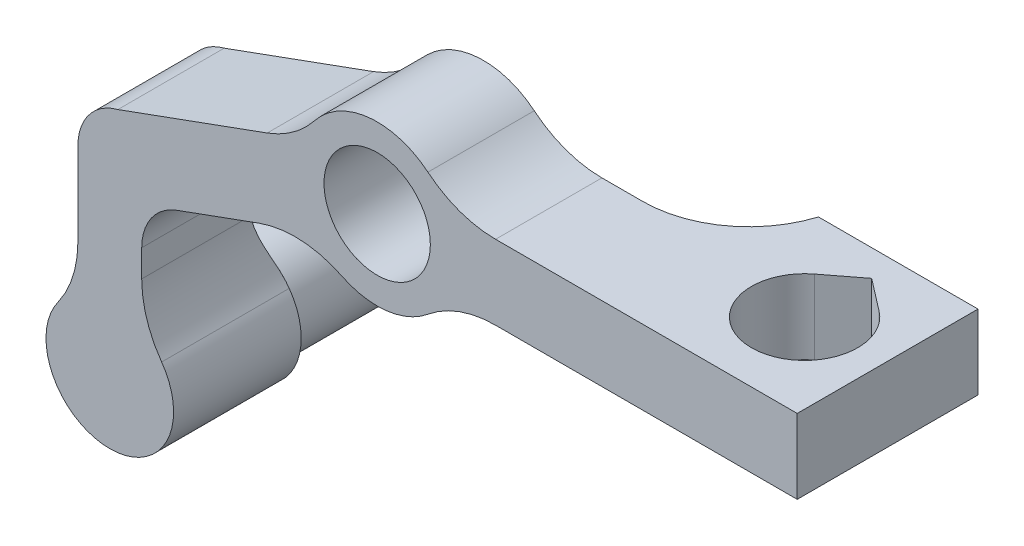
ISO-10303-21;
HEADER;
FILE_DESCRIPTION(('STEP AP214'),'2;1');
FILE_NAME('part.step','',(''),(''),'','','');
FILE_SCHEMA(('AUTOMOTIVE_DESIGN { 1 0 10303 214 1 1 1 1 }'));
ENDSEC;
DATA;
#1=APPLICATION_CONTEXT('core data for automotive mechanical design processes');
#2=APPLICATION_PROTOCOL_DEFINITION('international standard','automotive_design',2000,#1);
#3=PRODUCT_CONTEXT('',#1,'mechanical');
#4=PRODUCT('Part','Part','',(#3));
#5=PRODUCT_RELATED_PRODUCT_CATEGORY('part','',(#4));
#6=PRODUCT_DEFINITION_FORMATION('','',#4);
#7=PRODUCT_DEFINITION_CONTEXT('part definition',#1,'design');
#8=PRODUCT_DEFINITION('design','',#6,#7);
#9=PRODUCT_DEFINITION_SHAPE('','',#8);
#10=(LENGTH_UNIT() NAMED_UNIT(*) SI_UNIT(.MILLI.,.METRE.));
#11=(NAMED_UNIT(*) PLANE_ANGLE_UNIT() SI_UNIT($,.RADIAN.));
#12=(NAMED_UNIT(*) SI_UNIT($,.STERADIAN.) SOLID_ANGLE_UNIT());
#13=UNCERTAINTY_MEASURE_WITH_UNIT(LENGTH_MEASURE(1.E-05),#10,'distance_accuracy_value','');
#14=(GEOMETRIC_REPRESENTATION_CONTEXT(3) GLOBAL_UNCERTAINTY_ASSIGNED_CONTEXT((#13)) GLOBAL_UNIT_ASSIGNED_CONTEXT((#10,
#11,#12)) REPRESENTATION_CONTEXT('',''));
#15=CARTESIAN_POINT('',(0.,0.,0.));
#16=DIRECTION('',(0.,0.,1.));
#17=DIRECTION('',(1.,0.,0.));
#18=AXIS2_PLACEMENT_3D('',#15,#16,#17);
#19=CARTESIAN_POINT('',(0.,0.,-5.));
#20=DIRECTION('',(0.,0.,1.));
#21=DIRECTION('',(1.,0.,0.));
#22=AXIS2_PLACEMENT_3D('',#19,#20,#21);
#23=PLANE('',#22);
#24=CARTESIAN_POINT('',(0.,0.,-5.));
#25=DIRECTION('',(0.,0.,1.));
#26=DIRECTION('',(1.,0.,0.));
#27=AXIS2_PLACEMENT_3D('',#24,#25,#26);
#28=CIRCLE('',#27,5.);
#29=CARTESIAN_POINT('',(5.,0.,-5.));
#30=VERTEX_POINT('',#29);
#31=EDGE_CURVE('E281',#30,#30,#28,.T.);
#32=ORIENTED_EDGE('',*,*,#31,.T.);
#33=EDGE_LOOP('',(#32));
#34=FACE_BOUND('',#33,.T.);
#35=DIRECTION('',(0.,-1.,0.));
#36=VECTOR('',#35,1.);
#37=CARTESIAN_POINT('',(-22.1430839676829,-3.69545322482756,-5.));
#38=LINE('',#37,#36);
#39=CARTESIAN_POINT('',(-22.1430839676829,-13.8292024167432,-5.));
#40=VERTEX_POINT('',#39);
#41=CARTESIAN_POINT('',(-22.1430839676829,-14.0765031862053,-5.));
#42=VERTEX_POINT('',#41);
#43=EDGE_CURVE('E265',#40,#42,#38,.T.);
#44=ORIENTED_EDGE('',*,*,#43,.T.);
#45=CARTESIAN_POINT('',(-25.1430839676829,-25.6954532248276,-5.));
#46=DIRECTION('',(0.,0.,1.));
#47=DIRECTION('',(1.,0.,0.));
#48=AXIS2_PLACEMENT_3D('',#45,#46,#47);
#49=CIRCLE('',#48,12.);
#50=CARTESIAN_POINT('',(-28.1430839676829,-14.0765031862053,-5.));
#51=VERTEX_POINT('',#50);
#52=EDGE_CURVE('E327',#42,#51,#49,.T.);
#53=ORIENTED_EDGE('',*,*,#52,.T.);
#54=DIRECTION('',(0.,-1.,0.));
#55=VECTOR('',#54,1.);
#56=CARTESIAN_POINT('',(-28.1430839676829,-3.69545322482756,-5.));
#57=LINE('',#56,#55);
#58=CARTESIAN_POINT('',(-28.1430839676829,-8.53838025386968,-5.));
#59=VERTEX_POINT('',#58);
#60=EDGE_CURVE('E262',#59,#51,#57,.T.);
#61=ORIENTED_EDGE('',*,*,#60,.F.);
#62=CARTESIAN_POINT('',(-23.1430839676829,-8.53838025386968,-5.));
#63=DIRECTION('',(0.,0.,1.));
#64=DIRECTION('',(1.,0.,0.));
#65=AXIS2_PLACEMENT_3D('',#62,#63,#64);
#66=CIRCLE('',#65,5.);
#67=CARTESIAN_POINT('',(-24.3864896904352,-3.69545322482756,-5.));
#68=VERTEX_POINT('',#67);
#69=EDGE_CURVE('E322',#59,#68,#66,.F.);
#70=ORIENTED_EDGE('',*,*,#69,.T.);
#71=DIRECTION('',(-0.939692620785908,-0.342020143325669,0.));
#72=VECTOR('',#71,1.);
#73=CARTESIAN_POINT('',(-6.60660943281871,2.77589395776218,-5.));
#74=LINE('',#73,#72);
#75=CARTESIAN_POINT('',(-10.3382060479147,1.41770386357871,-5.));
#76=VERTEX_POINT('',#75);
#77=EDGE_CURVE('E284',#76,#68,#74,.T.);
#78=ORIENTED_EDGE('',*,*,#77,.F.);
#79=CARTESIAN_POINT('',(-13.7584074811714,10.8146300714378,-5.));
#80=DIRECTION('',(0.,0.,1.));
#81=DIRECTION('',(1.,0.,0.));
#82=AXIS2_PLACEMENT_3D('',#79,#80,#81);
#83=CIRCLE('',#82,10.);
#84=CARTESIAN_POINT('',(-5.89646034907346,4.63484145918762,-5.));
#85=VERTEX_POINT('',#84);
#86=EDGE_CURVE('E11',#76,#85,#83,.T.);
#87=ORIENTED_EDGE('',*,*,#86,.T.);
#88=CARTESIAN_POINT('',(0.,0.,-5.));
#89=DIRECTION('',(0.,0.,1.));
#90=DIRECTION('',(1.,0.,0.));
#91=AXIS2_PLACEMENT_3D('',#88,#89,#90);
#92=CIRCLE('',#91,7.5);
#93=CARTESIAN_POINT('',(4.7723694538543,5.78571428571429,-5.));
#94=VERTEX_POINT('',#93);
#95=EDGE_CURVE('E290',#94,#85,#92,.T.);
#96=ORIENTED_EDGE('',*,*,#95,.F.);
#97=CARTESIAN_POINT('',(11.13552872566,13.5,-5.));
#98=DIRECTION('',(0.,0.,1.));
#99=DIRECTION('',(1.,0.,0.));
#100=AXIS2_PLACEMENT_3D('',#97,#98,#99);
#101=CIRCLE('',#100,10.);
#102=CARTESIAN_POINT('',(11.13552872566,3.5,-5.));
#103=VERTEX_POINT('',#102);
#104=EDGE_CURVE('E396',#94,#103,#101,.T.);
#105=ORIENTED_EDGE('',*,*,#104,.T.);
#106=DIRECTION('',(1.,0.,0.));
#107=VECTOR('',#106,1.);
#108=CARTESIAN_POINT('',(-26.3411544693228,3.5,-5.));
#109=LINE('',#108,#107);
#110=CARTESIAN_POINT('',(14.9606079858305,3.5,-5.));
#111=VERTEX_POINT('',#110);
#112=EDGE_CURVE('E269',#103,#111,#109,.T.);
#113=ORIENTED_EDGE('',*,*,#112,.T.);
#114=DIRECTION('',(0.,1.,0.));
#115=VECTOR('',#114,1.);
#116=CARTESIAN_POINT('',(14.9606079858305,0.,-5.));
#117=LINE('',#116,#115);
#118=CARTESIAN_POINT('',(14.9606079858305,-3.5,-5.));
#119=VERTEX_POINT('',#118);
#120=EDGE_CURVE('E325',#111,#119,#117,.F.);
#121=ORIENTED_EDGE('',*,*,#120,.T.);
#122=DIRECTION('',(1.,0.,0.));
#123=VECTOR('',#122,1.);
#124=CARTESIAN_POINT('',(-26.3411544693228,-3.5,-5.));
#125=LINE('',#124,#123);
#126=CARTESIAN_POINT('',(11.13552872566,-3.5,-5.));
#127=VERTEX_POINT('',#126);
#128=EDGE_CURVE('E268',#127,#119,#125,.T.);
#129=ORIENTED_EDGE('',*,*,#128,.F.);
#130=CARTESIAN_POINT('',(11.13552872566,-13.5,-5.));
#131=DIRECTION('',(0.,0.,1.));
#132=DIRECTION('',(1.,0.,0.));
#133=AXIS2_PLACEMENT_3D('',#130,#131,#132);
#134=CIRCLE('',#133,10.);
#135=CARTESIAN_POINT('',(4.7723694538543,-5.78571428571428,-5.));
#136=VERTEX_POINT('',#135);
#137=EDGE_CURVE('E402',#127,#136,#134,.T.);
#138=ORIENTED_EDGE('',*,*,#137,.T.);
#139=CARTESIAN_POINT('',(-3.30093901865302,-6.73452311564331,-5.));
#140=VERTEX_POINT('',#139);
#141=EDGE_CURVE('E297',#140,#136,#92,.T.);
#142=ORIENTED_EDGE('',*,*,#141,.F.);
#143=CARTESIAN_POINT('',(-7.70219104352372,-15.7138872698344,-5.));
#144=DIRECTION('',(0.,0.,1.));
#145=DIRECTION('',(1.,0.,0.));
#146=AXIS2_PLACEMENT_3D('',#143,#144,#145);
#147=CIRCLE('',#146,10.);
#148=CARTESIAN_POINT('',(-11.1223924767804,-6.3169610619753,-5.));
#149=VERTEX_POINT('',#148);
#150=EDGE_CURVE('E406',#140,#149,#147,.T.);
#151=ORIENTED_EDGE('',*,*,#150,.T.);
#152=DIRECTION('',(-0.939692620785908,-0.342020143325669,0.));
#153=VECTOR('',#152,1.);
#154=CARTESIAN_POINT('',(-4.21246842953902,-3.80195438773918,-5.));
#155=LINE('',#154,#153);
#156=CARTESIAN_POINT('',(-18.8531846843113,-9.13073931281365,-5.));
#157=VERTEX_POINT('',#156);
#158=EDGE_CURVE('E282',#149,#157,#155,.T.);
#159=ORIENTED_EDGE('',*,*,#158,.T.);
#160=CARTESIAN_POINT('',(-17.1430839676829,-13.8292024167432,-5.));
#161=DIRECTION('',(0.,0.,1.));
#162=DIRECTION('',(1.,0.,0.));
#163=AXIS2_PLACEMENT_3D('',#160,#161,#162);
#164=CIRCLE('',#163,5.);
#165=EDGE_CURVE('E313',#157,#40,#164,.T.);
#166=ORIENTED_EDGE('',*,*,#165,.T.);
#167=EDGE_LOOP('',(#44,#53,#61,#70,#78,#87,#96,#105,#113,#121,#129,#138,#142,#151,#159,#166));
#168=FACE_BOUND('',#167,.T.);
#169=ADVANCED_FACE('F39',(#34,#168),#23,.F.);
#170=CARTESIAN_POINT('',(-4.21246842953902,-3.80195438773918,-5.));
#171=DIRECTION('',(0.342020143325669,-0.939692620785908,0.));
#172=DIRECTION('',(0.939692620785908,0.342020143325669,0.));
#173=AXIS2_PLACEMENT_3D('',#170,#171,#172);
#174=PLANE('',#173);
#175=ORIENTED_EDGE('',*,*,#158,.F.);
#176=DIRECTION('',(0.,0.,-1.));
#177=VECTOR('',#176,1.);
#178=CARTESIAN_POINT('',(-11.1223924767804,-6.3169610619753,-5.));
#179=LINE('',#178,#177);
#180=CARTESIAN_POINT('',(-11.1223924767804,-6.3169610619753,5.));
#181=VERTEX_POINT('',#180);
#182=EDGE_CURVE('E341',#149,#181,#179,.F.);
#183=ORIENTED_EDGE('',*,*,#182,.T.);
#184=DIRECTION('',(-0.939692620785908,-0.342020143325669,0.));
#185=VECTOR('',#184,1.);
#186=CARTESIAN_POINT('',(-4.21246842953902,-3.80195438773918,5.));
#187=LINE('',#186,#185);
#188=CARTESIAN_POINT('',(-18.8531846843113,-9.13073931281365,5.));
#189=VERTEX_POINT('',#188);
#190=EDGE_CURVE('E279',#181,#189,#187,.T.);
#191=ORIENTED_EDGE('',*,*,#190,.T.);
#192=DIRECTION('',(0.,0.,-1.));
#193=VECTOR('',#192,1.);
#194=CARTESIAN_POINT('',(-18.8531846843113,-9.13073931281365,-5.));
#195=LINE('',#194,#193);
#196=EDGE_CURVE('E308',#189,#157,#195,.T.);
#197=ORIENTED_EDGE('',*,*,#196,.T.);
#198=EDGE_LOOP('',(#175,#183,#191,#197));
#199=FACE_BOUND('',#198,.T.);
#200=ADVANCED_FACE('F490',(#199),#174,.T.);
#201=CARTESIAN_POINT('',(-6.60660943281871,2.77589395776218,-5.));
#202=DIRECTION('',(-0.342020143325669,0.939692620785908,0.));
#203=DIRECTION('',(-0.939692620785908,-0.342020143325669,0.));
#204=AXIS2_PLACEMENT_3D('',#201,#202,#203);
#205=PLANE('',#204);
#206=DIRECTION('',(-0.939692620785908,-0.342020143325669,0.));
#207=VECTOR('',#206,1.);
#208=CARTESIAN_POINT('',(-6.60660943281871,2.77589395776218,5.));
#209=LINE('',#208,#207);
#210=CARTESIAN_POINT('',(-10.3382060479147,1.41770386357871,5.));
#211=VERTEX_POINT('',#210);
#212=CARTESIAN_POINT('',(-24.3864896904353,-3.69545322482756,5.));
#213=VERTEX_POINT('',#212);
#214=EDGE_CURVE('E277',#211,#213,#209,.T.);
#215=ORIENTED_EDGE('',*,*,#214,.F.);
#216=DIRECTION('',(0.,0.,-1.));
#217=VECTOR('',#216,1.);
#218=CARTESIAN_POINT('',(-10.3382060479147,1.41770386357871,-5.));
#219=LINE('',#218,#217);
#220=EDGE_CURVE('E354',#211,#76,#219,.T.);
#221=ORIENTED_EDGE('',*,*,#220,.T.);
#222=ORIENTED_EDGE('',*,*,#77,.T.);
#223=DIRECTION('',(0.,0.,1.));
#224=VECTOR('',#223,1.);
#225=CARTESIAN_POINT('',(-24.3864896904353,-3.69545322482756,-4.99999999999998));
#226=LINE('',#225,#224);
#227=EDGE_CURVE('E300',#68,#213,#226,.T.);
#228=ORIENTED_EDGE('',*,*,#227,.T.);
#229=EDGE_LOOP('',(#215,#221,#222,#228));
#230=FACE_BOUND('',#229,.T.);
#231=ADVANCED_FACE('F438',(#230),#205,.T.);
#232=CARTESIAN_POINT('',(0.,0.,5.));
#233=DIRECTION('',(0.,0.,-1.));
#234=DIRECTION('',(-1.,0.,0.));
#235=AXIS2_PLACEMENT_3D('',#232,#233,#234);
#236=CYLINDRICAL_SURFACE('',#235,7.5);
#237=CARTESIAN_POINT('',(0.,0.,5.));
#238=DIRECTION('',(0.,0.,1.));
#239=DIRECTION('',(1.,0.,0.));
#240=AXIS2_PLACEMENT_3D('',#237,#238,#239);
#241=CIRCLE('',#240,7.5);
#242=CARTESIAN_POINT('',(-3.30093901865302,-6.73452311564331,5.));
#243=VERTEX_POINT('',#242);
#244=CARTESIAN_POINT('',(4.7723694538543,-5.78571428571428,5.));
#245=VERTEX_POINT('',#244);
#246=EDGE_CURVE('E296',#243,#245,#241,.T.);
#247=ORIENTED_EDGE('',*,*,#246,.F.);
#248=DIRECTION('',(0.,0.,-1.));
#249=VECTOR('',#248,1.);
#250=CARTESIAN_POINT('',(-3.30093901865302,-6.73452311564331,5.));
#251=LINE('',#250,#249);
#252=EDGE_CURVE('E338',#243,#140,#251,.T.);
#253=ORIENTED_EDGE('',*,*,#252,.T.);
#254=ORIENTED_EDGE('',*,*,#141,.T.);
#255=DIRECTION('',(0.,0.,-1.));
#256=VECTOR('',#255,1.);
#257=CARTESIAN_POINT('',(4.7723694538543,-5.78571428571428,5.));
#258=LINE('',#257,#256);
#259=EDGE_CURVE('E336',#136,#245,#258,.F.);
#260=ORIENTED_EDGE('',*,*,#259,.T.);
#261=EDGE_LOOP('',(#247,#253,#254,#260));
#262=FACE_BOUND('',#261,.T.);
#263=ADVANCED_FACE('F481',(#262),#236,.T.);
#264=CARTESIAN_POINT('',(0.,0.,5.));
#265=DIRECTION('',(0.,0.,1.));
#266=DIRECTION('',(1.,0.,0.));
#267=AXIS2_PLACEMENT_3D('',#264,#265,#266);
#268=PLANE('',#267);
#269=CARTESIAN_POINT('',(4.7723694538543,5.78571428571429,5.));
#270=VERTEX_POINT('',#269);
#271=CARTESIAN_POINT('',(-5.89646034907346,4.63484145918762,5.));
#272=VERTEX_POINT('',#271);
#273=EDGE_CURVE('E293',#270,#272,#241,.T.);
#274=ORIENTED_EDGE('',*,*,#273,.T.);
#275=CARTESIAN_POINT('',(-13.7584074811714,10.8146300714378,5.));
#276=DIRECTION('',(0.,0.,1.));
#277=DIRECTION('',(1.,0.,0.));
#278=AXIS2_PLACEMENT_3D('',#275,#276,#277);
#279=CIRCLE('',#278,10.);
#280=EDGE_CURVE('E54',#272,#211,#279,.F.);
#281=ORIENTED_EDGE('',*,*,#280,.T.);
#282=ORIENTED_EDGE('',*,*,#214,.T.);
#283=CARTESIAN_POINT('',(-23.1430839676829,-8.53838025386968,5.));
#284=DIRECTION('',(0.,0.,1.));
#285=DIRECTION('',(1.,0.,0.));
#286=AXIS2_PLACEMENT_3D('',#283,#284,#285);
#287=CIRCLE('',#286,5.);
#288=CARTESIAN_POINT('',(-28.1430839676829,-8.53838025386968,5.));
#289=VERTEX_POINT('',#288);
#290=EDGE_CURVE('E318',#213,#289,#287,.T.);
#291=ORIENTED_EDGE('',*,*,#290,.T.);
#292=DIRECTION('',(0.,-1.,0.));
#293=VECTOR('',#292,1.);
#294=CARTESIAN_POINT('',(-28.1430839676829,-3.69545322482756,5.));
#295=LINE('',#294,#293);
#296=CARTESIAN_POINT('',(-28.1430839676829,-16.3680741717387,5.));
#297=VERTEX_POINT('',#296);
#298=EDGE_CURVE('E259',#289,#297,#295,.T.);
#299=ORIENTED_EDGE('',*,*,#298,.T.);
#300=CARTESIAN_POINT('',(-38.1430839676829,-16.3680741717387,5.));
#301=DIRECTION('',(0.,0.,1.));
#302=DIRECTION('',(1.,0.,0.));
#303=AXIS2_PLACEMENT_3D('',#300,#301,#302);
#304=CIRCLE('',#303,10.);
#305=CARTESIAN_POINT('',(-30.0180839676829,-22.1976860799192,5.));
#306=VERTEX_POINT('',#305);
#307=EDGE_CURVE('E408',#297,#306,#304,.F.);
#308=ORIENTED_EDGE('',*,*,#307,.T.);
#309=CARTESIAN_POINT('',(-25.1430839676829,-25.6954532248276,5.));
#310=DIRECTION('',(0.,0.,1.));
#311=DIRECTION('',(1.,0.,0.));
#312=AXIS2_PLACEMENT_3D('',#309,#310,#311);
#313=CIRCLE('',#312,6.);
#314=CARTESIAN_POINT('',(-20.2680839676829,-22.1976860799192,5.));
#315=VERTEX_POINT('',#314);
#316=EDGE_CURVE('E500',#306,#315,#313,.T.);
#317=ORIENTED_EDGE('',*,*,#316,.T.);
#318=CARTESIAN_POINT('',(-12.1430839676829,-16.3680741717387,5.));
#319=DIRECTION('',(0.,0.,1.));
#320=DIRECTION('',(1.,0.,0.));
#321=AXIS2_PLACEMENT_3D('',#318,#319,#320);
#322=CIRCLE('',#321,10.);
#323=CARTESIAN_POINT('',(-22.1430839676829,-16.3680741717387,5.));
#324=VERTEX_POINT('',#323);
#325=EDGE_CURVE('E410',#315,#324,#322,.F.);
#326=ORIENTED_EDGE('',*,*,#325,.T.);
#327=DIRECTION('',(0.,-1.,0.));
#328=VECTOR('',#327,1.);
#329=CARTESIAN_POINT('',(-22.1430839676829,-3.69545322482756,5.));
#330=LINE('',#329,#328);
#331=CARTESIAN_POINT('',(-22.1430839676829,-13.8292024167432,5.));
#332=VERTEX_POINT('',#331);
#333=EDGE_CURVE('E257',#332,#324,#330,.T.);
#334=ORIENTED_EDGE('',*,*,#333,.F.);
#335=CARTESIAN_POINT('',(-17.1430839676829,-13.8292024167432,5.));
#336=DIRECTION('',(0.,0.,1.));
#337=DIRECTION('',(1.,0.,0.));
#338=AXIS2_PLACEMENT_3D('',#335,#336,#337);
#339=CIRCLE('',#338,5.);
#340=EDGE_CURVE('E315',#332,#189,#339,.F.);
#341=ORIENTED_EDGE('',*,*,#340,.T.);
#342=ORIENTED_EDGE('',*,*,#190,.F.);
#343=CARTESIAN_POINT('',(-7.70219104352372,-15.7138872698344,5.));
#344=DIRECTION('',(0.,0.,1.));
#345=DIRECTION('',(1.,0.,0.));
#346=AXIS2_PLACEMENT_3D('',#343,#344,#345);
#347=CIRCLE('',#346,10.);
#348=EDGE_CURVE('E404',#181,#243,#347,.F.);
#349=ORIENTED_EDGE('',*,*,#348,.T.);
#350=ORIENTED_EDGE('',*,*,#246,.T.);
#351=CARTESIAN_POINT('',(11.13552872566,-13.5,5.));
#352=DIRECTION('',(0.,0.,1.));
#353=DIRECTION('',(1.,0.,0.));
#354=AXIS2_PLACEMENT_3D('',#351,#352,#353);
#355=CIRCLE('',#354,10.);
#356=CARTESIAN_POINT('',(11.13552872566,-3.5,5.));
#357=VERTEX_POINT('',#356);
#358=EDGE_CURVE('E400',#245,#357,#355,.F.);
#359=ORIENTED_EDGE('',*,*,#358,.T.);
#360=DIRECTION('',(1.,0.,0.));
#361=VECTOR('',#360,1.);
#362=CARTESIAN_POINT('',(-26.3411544693228,-3.5,5.));
#363=LINE('',#362,#361);
#364=CARTESIAN_POINT('',(39.5,-3.5,5.));
#365=VERTEX_POINT('',#364);
#366=EDGE_CURVE('E272',#357,#365,#363,.T.);
#367=ORIENTED_EDGE('',*,*,#366,.T.);
#368=DIRECTION('',(0.,-1.,0.));
#369=VECTOR('',#368,1.);
#370=CARTESIAN_POINT('',(39.5,3.5,5.));
#371=LINE('',#370,#369);
#372=CARTESIAN_POINT('',(39.5,3.5,5.));
#373=VERTEX_POINT('',#372);
#374=EDGE_CURVE('E237',#373,#365,#371,.T.);
#375=ORIENTED_EDGE('',*,*,#374,.F.);
#376=DIRECTION('',(1.,0.,0.));
#377=VECTOR('',#376,1.);
#378=CARTESIAN_POINT('',(-26.3411544693228,3.5,5.));
#379=LINE('',#378,#377);
#380=CARTESIAN_POINT('',(11.13552872566,3.5,5.));
#381=VERTEX_POINT('',#380);
#382=EDGE_CURVE('E273',#381,#373,#379,.T.);
#383=ORIENTED_EDGE('',*,*,#382,.F.);
#384=CARTESIAN_POINT('',(11.13552872566,13.5,5.));
#385=DIRECTION('',(0.,0.,1.));
#386=DIRECTION('',(1.,0.,0.));
#387=AXIS2_PLACEMENT_3D('',#384,#385,#386);
#388=CIRCLE('',#387,10.);
#389=EDGE_CURVE('E398',#381,#270,#388,.F.);
#390=ORIENTED_EDGE('',*,*,#389,.T.);
#391=EDGE_LOOP('',(#274,#281,#282,#291,#299,#308,#317,#326,#334,#341,#342,#349,#350,#359,#367,
#375,#383,#390));
#392=FACE_BOUND('',#391,.T.);
#393=CARTESIAN_POINT('',(0.,0.,5.));
#394=DIRECTION('',(0.,0.,1.));
#395=DIRECTION('',(1.,0.,0.));
#396=AXIS2_PLACEMENT_3D('',#393,#394,#395);
#397=CIRCLE('',#396,5.);
#398=CARTESIAN_POINT('',(5.,0.,5.));
#399=VERTEX_POINT('',#398);
#400=EDGE_CURVE('E287',#399,#399,#397,.T.);
#401=ORIENTED_EDGE('',*,*,#400,.F.);
#402=EDGE_LOOP('',(#401));
#403=FACE_BOUND('',#402,.T.);
#404=ADVANCED_FACE('F450',(#392,#403),#268,.T.);
#405=ORIENTED_EDGE('',*,*,#273,.F.);
#406=DIRECTION('',(0.,0.,-1.));
#407=VECTOR('',#406,1.);
#408=CARTESIAN_POINT('',(4.7723694538543,5.78571428571429,5.));
#409=LINE('',#408,#407);
#410=EDGE_CURVE('E352',#270,#94,#409,.T.);
#411=ORIENTED_EDGE('',*,*,#410,.T.);
#412=ORIENTED_EDGE('',*,*,#95,.T.);
#413=DIRECTION('',(0.,0.,-1.));
#414=VECTOR('',#413,1.);
#415=CARTESIAN_POINT('',(-5.89646034907346,4.63484145918762,5.));
#416=LINE('',#415,#414);
#417=EDGE_CURVE('E349',#85,#272,#416,.F.);
#418=ORIENTED_EDGE('',*,*,#417,.T.);
#419=EDGE_LOOP('',(#405,#411,#412,#418));
#420=FACE_BOUND('',#419,.T.);
#421=ADVANCED_FACE('F447',(#420),#236,.T.);
#422=CARTESIAN_POINT('',(0.,0.,5.));
#423=DIRECTION('',(0.,0.,-1.));
#424=DIRECTION('',(-1.,0.,0.));
#425=AXIS2_PLACEMENT_3D('',#422,#423,#424);
#426=CYLINDRICAL_SURFACE('',#425,5.);
#427=ORIENTED_EDGE('',*,*,#400,.T.);
#428=EDGE_LOOP('',(#427));
#429=FACE_BOUND('',#428,.T.);
#430=ORIENTED_EDGE('',*,*,#31,.F.);
#431=EDGE_LOOP('',(#430));
#432=FACE_BOUND('',#431,.T.);
#433=ADVANCED_FACE('F525',(#429,#432),#426,.F.);
#434=CARTESIAN_POINT('',(-26.3411544693228,-3.5,5.));
#435=DIRECTION('',(0.,-1.,0.));
#436=DIRECTION('',(0.,0.,-1.));
#437=AXIS2_PLACEMENT_3D('',#434,#435,#436);
#438=PLANE('',#437);
#439=CARTESIAN_POINT('',(32.,-3.5,-3.19287620239325));
#440=DIRECTION('',(0.,-1.,0.));
#441=DIRECTION('',(0.,0.,-1.));
#442=AXIS2_PLACEMENT_3D('',#439,#440,#441);
#443=CIRCLE('',#442,5.);
#444=CARTESIAN_POINT('',(35.0477060920935,-3.5,-7.15664808990342));
#445=VERTEX_POINT('',#444);
#446=CARTESIAN_POINT('',(28.9522939079065,-3.5,-7.15664808990341));
#447=VERTEX_POINT('',#446);
#448=EDGE_CURVE('E229',#445,#447,#443,.T.);
#449=ORIENTED_EDGE('',*,*,#448,.F.);
#450=DIRECTION('',(0.792754377502034,0.,0.609541218418708));
#451=VECTOR('',#450,1.);
#452=CARTESIAN_POINT('',(32.,-3.5,-9.5));
#453=LINE('',#452,#451);
#454=CARTESIAN_POINT('',(32.,-3.5,-9.5));
#455=VERTEX_POINT('',#454);
#456=EDGE_CURVE('E214',#455,#445,#453,.T.);
#457=ORIENTED_EDGE('',*,*,#456,.F.);
#458=DIRECTION('',(0.792754377502033,0.,-0.609541218418709));
#459=VECTOR('',#458,1.);
#460=CARTESIAN_POINT('',(32.,-3.5,-9.5));
#461=LINE('',#460,#459);
#462=EDGE_CURVE('E225',#447,#455,#461,.T.);
#463=ORIENTED_EDGE('',*,*,#462,.F.);
#464=EDGE_LOOP('',(#449,#457,#463));
#465=FACE_BOUND('',#464,.T.);
#466=ORIENTED_EDGE('',*,*,#366,.F.);
#467=DIRECTION('',(0.,0.,-1.));
#468=VECTOR('',#467,1.);
#469=CARTESIAN_POINT('',(11.13552872566,-3.5,5.));
#470=LINE('',#469,#468);
#471=EDGE_CURVE('E343',#357,#127,#470,.T.);
#472=ORIENTED_EDGE('',*,*,#471,.T.);
#473=ORIENTED_EDGE('',*,*,#128,.T.);
#474=CARTESIAN_POINT('',(14.9606079858305,-3.5,-15.));
#475=DIRECTION('',(0.,-1.,0.));
#476=DIRECTION('',(0.,0.,-1.));
#477=AXIS2_PLACEMENT_3D('',#474,#475,#476);
#478=CIRCLE('',#477,10.);
#479=CARTESIAN_POINT('',(24.5,-3.5,-12.));
#480=VERTEX_POINT('',#479);
#481=EDGE_CURVE('E412',#119,#480,#478,.F.);
#482=ORIENTED_EDGE('',*,*,#481,.T.);
#483=DIRECTION('',(-1.,0.,0.));
#484=VECTOR('',#483,1.);
#485=CARTESIAN_POINT('',(39.5,-3.5,-12.));
#486=LINE('',#485,#484);
#487=CARTESIAN_POINT('',(39.5,-3.5,-12.));
#488=VERTEX_POINT('',#487);
#489=EDGE_CURVE('E246',#488,#480,#486,.T.);
#490=ORIENTED_EDGE('',*,*,#489,.F.);
#491=DIRECTION('',(0.,0.,1.));
#492=VECTOR('',#491,1.);
#493=CARTESIAN_POINT('',(39.5,-3.5,-12.));
#494=LINE('',#493,#492);
#495=EDGE_CURVE('E249',#488,#365,#494,.T.);
#496=ORIENTED_EDGE('',*,*,#495,.T.);
#497=EDGE_LOOP('',(#466,#472,#473,#482,#490,#496));
#498=FACE_BOUND('',#497,.T.);
#499=ADVANCED_FACE('F231',(#465,#498),#438,.T.);
#500=CARTESIAN_POINT('',(-26.3411544693228,3.5,5.));
#501=DIRECTION('',(0.,1.,0.));
#502=DIRECTION('',(0.,0.,1.));
#503=AXIS2_PLACEMENT_3D('',#500,#501,#502);
#504=PLANE('',#503);
#505=CARTESIAN_POINT('',(32.,3.5,-3.19287620239325));
#506=DIRECTION('',(0.,1.,0.));
#507=DIRECTION('',(0.,0.,1.));
#508=AXIS2_PLACEMENT_3D('',#505,#506,#507);
#509=CIRCLE('',#508,5.);
#510=CARTESIAN_POINT('',(28.9522939079065,3.5,-7.15664808990342));
#511=VERTEX_POINT('',#510);
#512=CARTESIAN_POINT('',(35.0477060920935,3.5,-7.15664808990342));
#513=VERTEX_POINT('',#512);
#514=EDGE_CURVE('E306',#511,#513,#509,.T.);
#515=ORIENTED_EDGE('',*,*,#514,.F.);
#516=DIRECTION('',(-0.792754377502033,0.,0.609541218418709));
#517=VECTOR('',#516,1.);
#518=CARTESIAN_POINT('',(-11.6716917480299,3.5,24.0787438757248));
#519=LINE('',#518,#517);
#520=CARTESIAN_POINT('',(32.,3.5,-9.49999999999999));
#521=VERTEX_POINT('',#520);
#522=EDGE_CURVE('E303',#521,#511,#519,.T.);
#523=ORIENTED_EDGE('',*,*,#522,.F.);
#524=DIRECTION('',(-0.792754377502034,0.,-0.609541218418707));
#525=VECTOR('',#524,1.);
#526=CARTESIAN_POINT('',(2.34158585788123,3.5,-32.3040694641353));
#527=LINE('',#526,#525);
#528=EDGE_CURVE('E217',#513,#521,#527,.T.);
#529=ORIENTED_EDGE('',*,*,#528,.F.);
#530=EDGE_LOOP('',(#515,#523,#529));
#531=FACE_BOUND('',#530,.T.);
#532=ORIENTED_EDGE('',*,*,#112,.F.);
#533=DIRECTION('',(0.,0.,-1.));
#534=VECTOR('',#533,1.);
#535=CARTESIAN_POINT('',(11.13552872566,3.5,5.));
#536=LINE('',#535,#534);
#537=EDGE_CURVE('E346',#103,#381,#536,.F.);
#538=ORIENTED_EDGE('',*,*,#537,.T.);
#539=ORIENTED_EDGE('',*,*,#382,.T.);
#540=DIRECTION('',(0.,0.,1.));
#541=VECTOR('',#540,1.);
#542=CARTESIAN_POINT('',(39.5,3.5,-12.));
#543=LINE('',#542,#541);
#544=CARTESIAN_POINT('',(39.5,3.5,-12.));
#545=VERTEX_POINT('',#544);
#546=EDGE_CURVE('E254',#545,#373,#543,.T.);
#547=ORIENTED_EDGE('',*,*,#546,.F.);
#548=DIRECTION('',(1.,0.,0.));
#549=VECTOR('',#548,1.);
#550=CARTESIAN_POINT('',(39.5,3.5,-12.));
#551=LINE('',#550,#549);
#552=CARTESIAN_POINT('',(24.5,3.5,-12.));
#553=VERTEX_POINT('',#552);
#554=EDGE_CURVE('E242',#553,#545,#551,.T.);
#555=ORIENTED_EDGE('',*,*,#554,.F.);
#556=CARTESIAN_POINT('',(14.9606079858305,3.5,-15.));
#557=DIRECTION('',(0.,1.,0.));
#558=DIRECTION('',(0.,0.,1.));
#559=AXIS2_PLACEMENT_3D('',#556,#557,#558);
#560=CIRCLE('',#559,10.);
#561=EDGE_CURVE('E413',#553,#111,#560,.F.);
#562=ORIENTED_EDGE('',*,*,#561,.T.);
#563=EDGE_LOOP('',(#532,#538,#539,#547,#555,#562));
#564=FACE_BOUND('',#563,.T.);
#565=ADVANCED_FACE('F458',(#531,#564),#504,.T.);
#566=CARTESIAN_POINT('',(-22.1430839676829,-3.69545322482756,5.));
#567=DIRECTION('',(-1.,0.,0.));
#568=DIRECTION('',(0.,0.,1.));
#569=AXIS2_PLACEMENT_3D('',#566,#567,#568);
#570=PLANE('',#569);
#571=ORIENTED_EDGE('',*,*,#333,.T.);
#572=DIRECTION('',(0.,0.,1.));
#573=VECTOR('',#572,1.);
#574=CARTESIAN_POINT('',(-22.1430839676829,-16.3680741717387,5.));
#575=LINE('',#574,#573);
#576=CARTESIAN_POINT('',(-22.1430839676829,-16.3680741717387,-5.24546180964034));
#577=VERTEX_POINT('',#576);
#578=EDGE_CURVE('E62',#324,#577,#575,.F.);
#579=ORIENTED_EDGE('',*,*,#578,.T.);
#580=CARTESIAN_POINT('',(-22.1430839676829,-16.3680741717387,-5.24546180964034));
#581=CARTESIAN_POINT('',(-22.1430839676829,-16.179702392601,-5.2049721228449));
#582=CARTESIAN_POINT('',(-22.1430839676829,-15.9902762887036,-5.16935417384789));
#583=CARTESIAN_POINT('',(-22.1430839676829,-15.6103533299134,-5.10816064832956));
#584=CARTESIAN_POINT('',(-22.1430839676829,-15.4198609475846,-5.08255728156386));
#585=CARTESIAN_POINT('',(-22.1430839676829,-15.0377715280384,-5.04146176461505));
#586=CARTESIAN_POINT('',(-22.1430839676829,-14.8461744157324,-5.02597031011278));
#587=CARTESIAN_POINT('',(-22.1430839676829,-14.4618891802004,-5.00522150807399));
#588=CARTESIAN_POINT('',(-22.1430839676829,-14.2691995042129,-4.99999296832467));
#589=CARTESIAN_POINT('',(-22.1430839676829,-14.0765031862053,-5.));
#590=B_SPLINE_CURVE_WITH_KNOTS('',3,(#580,#581,#582,#583,#584,#585,#586,#587,#588,#589),
.UNSPECIFIED.,.F.,.F.,(4,2,2,2,4),(0.,0.577968513637952,1.15432160166251,1.73071433753454,
2.30872269509582),.UNSPECIFIED.);
#591=EDGE_CURVE('E363',#577,#42,#590,.T.);
#592=ORIENTED_EDGE('',*,*,#591,.T.);
#593=ORIENTED_EDGE('',*,*,#43,.F.);
#594=DIRECTION('',(0.,0.,-1.));
#595=VECTOR('',#594,1.);
#596=CARTESIAN_POINT('',(-22.1430839676829,-13.8292024167432,5.));
#597=LINE('',#596,#595);
#598=EDGE_CURVE('E311',#40,#332,#597,.F.);
#599=ORIENTED_EDGE('',*,*,#598,.T.);
#600=EDGE_LOOP('',(#571,#579,#592,#593,#599));
#601=FACE_BOUND('',#600,.T.);
#602=ADVANCED_FACE('F419',(#601),#570,.F.);
#603=CARTESIAN_POINT('',(-28.1430839676829,-3.69545322482756,5.));
#604=DIRECTION('',(1.,0.,0.));
#605=DIRECTION('',(0.,0.,-1.));
#606=AXIS2_PLACEMENT_3D('',#603,#604,#605);
#607=PLANE('',#606);
#608=CARTESIAN_POINT('',(-28.1430839676829,-14.0765031862053,-5.));
#609=CARTESIAN_POINT('',(-28.1430839676829,-14.2691995042129,-4.99999296832467));
#610=CARTESIAN_POINT('',(-28.1430839676829,-14.4618891802004,-5.00522150807399));
#611=CARTESIAN_POINT('',(-28.1430839676829,-14.8461744157324,-5.02597031011278));
#612=CARTESIAN_POINT('',(-28.1430839676829,-15.0377715280384,-5.04146176461505));
#613=CARTESIAN_POINT('',(-28.1430839676829,-15.4198609475846,-5.08255728156386));
#614=CARTESIAN_POINT('',(-28.1430839676829,-15.6103533299134,-5.10816064832956));
#615=CARTESIAN_POINT('',(-28.1430839676829,-15.9902762887036,-5.16935417384789));
#616=CARTESIAN_POINT('',(-28.1430839676829,-16.179702392601,-5.2049721228449));
#617=CARTESIAN_POINT('',(-28.1430839676829,-16.3680741717387,-5.24546180964034));
#618=B_SPLINE_CURVE_WITH_KNOTS('',3,(#608,#609,#610,#611,#612,#613,#614,#615,#616,#617),
.UNSPECIFIED.,.F.,.F.,(4,2,2,2,4),(0.,0.578008357561275,1.15440109343331,1.73075418145786,
2.30872269509582),.UNSPECIFIED.);
#619=CARTESIAN_POINT('',(-28.1430839676829,-16.3680741717387,-5.24546180964034));
#620=VERTEX_POINT('',#619);
#621=EDGE_CURVE('E356',#51,#620,#618,.T.);
#622=ORIENTED_EDGE('',*,*,#621,.T.);
#623=DIRECTION('',(0.,0.,1.));
#624=VECTOR('',#623,1.);
#625=CARTESIAN_POINT('',(-28.1430839676829,-16.3680741717387,5.));
#626=LINE('',#625,#624);
#627=EDGE_CURVE('E70',#620,#297,#626,.T.);
#628=ORIENTED_EDGE('',*,*,#627,.T.);
#629=ORIENTED_EDGE('',*,*,#298,.F.);
#630=DIRECTION('',(0.,0.,-1.));
#631=VECTOR('',#630,1.);
#632=CARTESIAN_POINT('',(-28.1430839676829,-8.53838025386968,5.));
#633=LINE('',#632,#631);
#634=EDGE_CURVE('E320',#289,#59,#633,.T.);
#635=ORIENTED_EDGE('',*,*,#634,.T.);
#636=ORIENTED_EDGE('',*,*,#60,.T.);
#637=EDGE_LOOP('',(#622,#628,#629,#635,#636));
#638=FACE_BOUND('',#637,.T.);
#639=ADVANCED_FACE('F370',(#638),#607,.F.);
#640=CARTESIAN_POINT('',(39.5,3.5,-12.));
#641=DIRECTION('',(-1.,0.,0.));
#642=DIRECTION('',(0.,0.,1.));
#643=AXIS2_PLACEMENT_3D('',#640,#641,#642);
#644=PLANE('',#643);
#645=ORIENTED_EDGE('',*,*,#374,.T.);
#646=ORIENTED_EDGE('',*,*,#495,.F.);
#647=DIRECTION('',(0.,-1.,0.));
#648=VECTOR('',#647,1.);
#649=CARTESIAN_POINT('',(39.5,3.5,-12.));
#650=LINE('',#649,#648);
#651=EDGE_CURVE('E244',#545,#488,#650,.T.);
#652=ORIENTED_EDGE('',*,*,#651,.F.);
#653=ORIENTED_EDGE('',*,*,#546,.T.);
#654=EDGE_LOOP('',(#645,#646,#652,#653));
#655=FACE_BOUND('',#654,.T.);
#656=ADVANCED_FACE('F472',(#655),#644,.F.);
#657=CARTESIAN_POINT('',(0.,0.,-12.));
#658=DIRECTION('',(0.,0.,-1.));
#659=DIRECTION('',(-1.,0.,0.));
#660=AXIS2_PLACEMENT_3D('',#657,#658,#659);
#661=PLANE('',#660);
#662=DIRECTION('',(0.,1.,0.));
#663=VECTOR('',#662,1.);
#664=CARTESIAN_POINT('',(24.5,3.5,-12.));
#665=LINE('',#664,#663);
#666=EDGE_CURVE('E239',#480,#553,#665,.T.);
#667=ORIENTED_EDGE('',*,*,#666,.T.);
#668=ORIENTED_EDGE('',*,*,#554,.T.);
#669=ORIENTED_EDGE('',*,*,#651,.T.);
#670=ORIENTED_EDGE('',*,*,#489,.T.);
#671=EDGE_LOOP('',(#667,#668,#669,#670));
#672=FACE_BOUND('',#671,.T.);
#673=ADVANCED_FACE('F468',(#672),#661,.T.);
#674=CARTESIAN_POINT('',(32.,7.5,-3.19287620239325));
#675=DIRECTION('',(0.,-1.,0.));
#676=DIRECTION('',(0.,0.,-1.));
#677=AXIS2_PLACEMENT_3D('',#674,#675,#676);
#678=CYLINDRICAL_SURFACE('',#677,5.);
#679=ORIENTED_EDGE('',*,*,#514,.T.);
#680=DIRECTION('',(0.,-1.,0.));
#681=VECTOR('',#680,1.);
#682=CARTESIAN_POINT('',(35.0477060920935,7.5,-7.15664808990342));
#683=LINE('',#682,#681);
#684=EDGE_CURVE('E220',#513,#445,#683,.T.);
#685=ORIENTED_EDGE('',*,*,#684,.T.);
#686=ORIENTED_EDGE('',*,*,#448,.T.);
#687=DIRECTION('',(0.,-1.,0.));
#688=VECTOR('',#687,1.);
#689=CARTESIAN_POINT('',(28.9522939079065,7.5,-7.15664808990342));
#690=LINE('',#689,#688);
#691=EDGE_CURVE('E221',#511,#447,#690,.T.);
#692=ORIENTED_EDGE('',*,*,#691,.F.);
#693=EDGE_LOOP('',(#679,#685,#686,#692));
#694=FACE_BOUND('',#693,.T.);
#695=ADVANCED_FACE('F516',(#694),#678,.F.);
#696=CARTESIAN_POINT('',(32.,7.5,-9.5));
#697=DIRECTION('',(0.609541218418707,0.,-0.792754377502034));
#698=DIRECTION('',(-0.792754377502034,0.,-0.609541218418707));
#699=AXIS2_PLACEMENT_3D('',#696,#697,#698);
#700=PLANE('',#699);
#701=ORIENTED_EDGE('',*,*,#528,.T.);
#702=DIRECTION('',(0.,-1.,0.));
#703=VECTOR('',#702,1.);
#704=CARTESIAN_POINT('',(32.,7.5,-9.5));
#705=LINE('',#704,#703);
#706=EDGE_CURVE('E209',#521,#455,#705,.T.);
#707=ORIENTED_EDGE('',*,*,#706,.T.);
#708=ORIENTED_EDGE('',*,*,#456,.T.);
#709=ORIENTED_EDGE('',*,*,#684,.F.);
#710=EDGE_LOOP('',(#701,#707,#708,#709));
#711=FACE_BOUND('',#710,.T.);
#712=ADVANCED_FACE('F211',(#711),#700,.F.);
#713=CARTESIAN_POINT('',(32.,7.5,-9.5));
#714=DIRECTION('',(-0.609541218418709,0.,-0.792754377502033));
#715=DIRECTION('',(-0.792754377502033,0.,0.609541218418709));
#716=AXIS2_PLACEMENT_3D('',#713,#714,#715);
#717=PLANE('',#716);
#718=ORIENTED_EDGE('',*,*,#522,.T.);
#719=ORIENTED_EDGE('',*,*,#691,.T.);
#720=ORIENTED_EDGE('',*,*,#462,.T.);
#721=ORIENTED_EDGE('',*,*,#706,.F.);
#722=EDGE_LOOP('',(#718,#719,#720,#721));
#723=FACE_BOUND('',#722,.T.);
#724=ADVANCED_FACE('F226',(#723),#717,.F.);
#725=CARTESIAN_POINT('',(-25.1430839676829,-25.6954532248276,-7.));
#726=DIRECTION('',(0.,0.,1.));
#727=DIRECTION('',(1.,0.,0.));
#728=AXIS2_PLACEMENT_3D('',#725,#726,#727);
#729=CYLINDRICAL_SURFACE('',#728,6.);
#730=CARTESIAN_POINT('',(-25.1430839676829,-25.6954532248276,-7.));
#731=DIRECTION('',(0.,0.,1.));
#732=DIRECTION('',(1.,0.,0.));
#733=AXIS2_PLACEMENT_3D('',#730,#731,#732);
#734=CIRCLE('',#733,6.);
#735=CARTESIAN_POINT('',(-30.0180839676829,-22.1976860799192,-7.));
#736=VERTEX_POINT('',#735);
#737=CARTESIAN_POINT('',(-20.2680839676829,-22.1976860799192,-7.));
#738=VERTEX_POINT('',#737);
#739=EDGE_CURVE('E514',#736,#738,#734,.T.);
#740=ORIENTED_EDGE('',*,*,#739,.T.);
#741=DIRECTION('',(0.,0.,1.));
#742=VECTOR('',#741,1.);
#743=CARTESIAN_POINT('',(-20.2680839676829,-22.1976860799192,-7.));
#744=LINE('',#743,#742);
#745=EDGE_CURVE('E332',#738,#315,#744,.T.);
#746=ORIENTED_EDGE('',*,*,#745,.T.);
#747=ORIENTED_EDGE('',*,*,#316,.F.);
#748=DIRECTION('',(0.,0.,1.));
#749=VECTOR('',#748,1.);
#750=CARTESIAN_POINT('',(-30.0180839676829,-22.1976860799192,-7.));
#751=LINE('',#750,#749);
#752=EDGE_CURVE('E330',#306,#736,#751,.F.);
#753=ORIENTED_EDGE('',*,*,#752,.T.);
#754=EDGE_LOOP('',(#740,#746,#747,#753));
#755=FACE_BOUND('',#754,.T.);
#756=ADVANCED_FACE('F633',(#755),#729,.T.);
#757=CARTESIAN_POINT('',(-25.1430839676829,-25.6954532248276,-7.));
#758=DIRECTION('',(0.,0.,1.));
#759=DIRECTION('',(1.,0.,0.));
#760=AXIS2_PLACEMENT_3D('',#757,#758,#759);
#761=PLANE('',#760);
#762=CARTESIAN_POINT('',(-25.1430839676829,-25.6954532248276,-7.));
#763=DIRECTION('',(0.,0.,1.));
#764=DIRECTION('',(1.,0.,0.));
#765=AXIS2_PLACEMENT_3D('',#762,#763,#764);
#766=CIRCLE('',#765,5.);
#767=CARTESIAN_POINT('',(-20.1430839676829,-25.6954532248276,-7.));
#768=VERTEX_POINT('',#767);
#769=EDGE_CURVE('E503',#768,#768,#766,.T.);
#770=ORIENTED_EDGE('',*,*,#769,.T.);
#771=EDGE_LOOP('',(#770));
#772=FACE_BOUND('',#771,.T.);
#773=EDGE_CURVE('E512',#738,#736,#734,.T.);
#774=ORIENTED_EDGE('',*,*,#773,.F.);
#775=ORIENTED_EDGE('',*,*,#739,.F.);
#776=EDGE_LOOP('',(#774,#775));
#777=FACE_BOUND('',#776,.T.);
#778=ADVANCED_FACE('F625',(#772,#777),#761,.F.);
#779=CARTESIAN_POINT('',(-25.1430839676829,-25.6954532248276,-30.));
#780=DIRECTION('',(0.,0.,1.));
#781=DIRECTION('',(1.,0.,0.));
#782=AXIS2_PLACEMENT_3D('',#779,#780,#781);
#783=CYLINDRICAL_SURFACE('',#782,5.);
#784=CARTESIAN_POINT('',(-25.1430839676829,-25.6954532248276,-30.));
#785=DIRECTION('',(0.,0.,1.));
#786=DIRECTION('',(1.,0.,0.));
#787=AXIS2_PLACEMENT_3D('',#784,#785,#786);
#788=CIRCLE('',#787,5.);
#789=CARTESIAN_POINT('',(-20.1430839676829,-25.6954532248276,-30.));
#790=VERTEX_POINT('',#789);
#791=EDGE_CURVE('E505',#790,#790,#788,.T.);
#792=ORIENTED_EDGE('',*,*,#791,.T.);
#793=EDGE_LOOP('',(#792));
#794=FACE_BOUND('',#793,.T.);
#795=ORIENTED_EDGE('',*,*,#769,.F.);
#796=EDGE_LOOP('',(#795));
#797=FACE_BOUND('',#796,.T.);
#798=ADVANCED_FACE('F616',(#794,#797),#783,.T.);
#799=CARTESIAN_POINT('',(-25.1430839676829,-25.6954532248276,-30.));
#800=DIRECTION('',(0.,0.,1.));
#801=DIRECTION('',(1.,0.,0.));
#802=AXIS2_PLACEMENT_3D('',#799,#800,#801);
#803=PLANE('',#802);
#804=ORIENTED_EDGE('',*,*,#791,.F.);
#805=EDGE_LOOP('',(#804));
#806=FACE_BOUND('',#805,.T.);
#807=ADVANCED_FACE('F541',(#806),#803,.F.);
#808=CARTESIAN_POINT('',(-17.1430839676829,-13.8292024167432,-5.));
#809=DIRECTION('',(0.,0.,-1.));
#810=DIRECTION('',(-1.,0.,0.));
#811=AXIS2_PLACEMENT_3D('',#808,#809,#810);
#812=CYLINDRICAL_SURFACE('',#811,5.);
#813=ORIENTED_EDGE('',*,*,#340,.F.);
#814=ORIENTED_EDGE('',*,*,#598,.F.);
#815=ORIENTED_EDGE('',*,*,#165,.F.);
#816=ORIENTED_EDGE('',*,*,#196,.F.);
#817=EDGE_LOOP('',(#813,#814,#815,#816));
#818=FACE_BOUND('',#817,.T.);
#819=ADVANCED_FACE('F495',(#818),#812,.F.);
#820=CARTESIAN_POINT('',(-23.1430839676829,-8.53838025386968,0.));
#821=DIRECTION('',(0.,0.,-1.));
#822=DIRECTION('',(-1.,0.,0.));
#823=AXIS2_PLACEMENT_3D('',#820,#821,#822);
#824=CYLINDRICAL_SURFACE('',#823,5.);
#825=ORIENTED_EDGE('',*,*,#69,.F.);
#826=ORIENTED_EDGE('',*,*,#634,.F.);
#827=ORIENTED_EDGE('',*,*,#290,.F.);
#828=ORIENTED_EDGE('',*,*,#227,.F.);
#829=EDGE_LOOP('',(#825,#826,#827,#828));
#830=FACE_BOUND('',#829,.T.);
#831=ADVANCED_FACE('F434',(#830),#824,.T.);
#832=CARTESIAN_POINT('',(-12.1430839676829,-16.3680741717387,-7.));
#833=DIRECTION('',(0.,0.,1.));
#834=DIRECTION('',(1.,0.,0.));
#835=AXIS2_PLACEMENT_3D('',#832,#833,#834);
#836=CYLINDRICAL_SURFACE('',#835,10.);
#837=ORIENTED_EDGE('',*,*,#325,.F.);
#838=ORIENTED_EDGE('',*,*,#745,.F.);
#839=CARTESIAN_POINT('',(-20.2680839676829,-22.1976860799192,-7.));
#840=CARTESIAN_POINT('',(-20.3096683139029,-22.1397314109233,-7.00001209047432));
#841=CARTESIAN_POINT('',(-20.3506270931754,-22.0813328390575,-6.99847391108424));
#842=CARTESIAN_POINT('',(-20.4312067443134,-21.9637945233637,-6.99238683727588));
#843=CARTESIAN_POINT('',(-20.4708279364771,-21.9046549616908,-6.9878386690811));
#844=CARTESIAN_POINT('',(-20.5485592255441,-21.7859159743336,-6.97583781184894));
#845=CARTESIAN_POINT('',(-20.5866731623841,-21.7263182508533,-6.96839310854367));
#846=CARTESIAN_POINT('',(-20.661451807556,-21.6066226997041,-6.95076544551608));
#847=CARTESIAN_POINT('',(-20.6981164399079,-21.5465248460153,-6.94058234245041));
#848=CARTESIAN_POINT('',(-20.8051885210233,-21.3667998557426,-6.90644521474964));
#849=CARTESIAN_POINT('',(-20.8734360047461,-21.2465752516421,-6.87877800921797));
#850=CARTESIAN_POINT('',(-21.0040932206454,-21.0050346152715,-6.81537031558215));
#851=CARTESIAN_POINT('',(-21.066498523988,-20.8837178301966,-6.77962377167662));
#852=CARTESIAN_POINT('',(-21.1836297526985,-20.6442533467362,-6.70335012372157));
#853=CARTESIAN_POINT('',(-21.2385408211581,-20.5261327533817,-6.66301907174833));
#854=CARTESIAN_POINT('',(-21.3432336960509,-20.2890489360034,-6.57835819629151));
#855=CARTESIAN_POINT('',(-21.3930146285892,-20.1700855720941,-6.5340276939243));
#856=CARTESIAN_POINT('',(-21.4876887462633,-19.9310645911029,-6.4427970481334));
#857=CARTESIAN_POINT('',(-21.5325771656707,-19.811006028381,-6.3958944649446));
#858=CARTESIAN_POINT('',(-21.6175662594045,-19.5697212125275,-6.30082089554059));
#859=CARTESIAN_POINT('',(-21.65766733635,-19.4484950585192,-6.25265001640652));
#860=CARTESIAN_POINT('',(-21.7333765415173,-19.2040470881855,-6.15586161263509));
#861=CARTESIAN_POINT('',(-21.7689607216666,-19.0808182484681,-6.10724306294837));
#862=CARTESIAN_POINT('',(-21.8354269335055,-18.8328185650296,-6.01073040922635));
#863=CARTESIAN_POINT('',(-21.8663087054731,-18.7080476365476,-5.96283634533711));
#864=CARTESIAN_POINT('',(-21.9518168563579,-18.3314927169847,-5.82157313967758));
#865=CARTESIAN_POINT('',(-21.9993951289295,-18.0771797093514,-5.73050516520709));
#866=CARTESIAN_POINT('',(-22.0719650057689,-17.582428385861,-5.56669129752984));
#867=CARTESIAN_POINT('',(-22.0984595634984,-17.3425086312139,-5.49306234245211));
#868=CARTESIAN_POINT('',(-22.1251245444115,-16.9792771733373,-5.39240392843091));
#869=CARTESIAN_POINT('',(-22.1318331970616,-16.8577657409984,-5.36050924029373));
#870=CARTESIAN_POINT('',(-22.1408138283737,-16.613674098974,-5.30025315737584));
#871=CARTESIAN_POINT('',(-22.1430846004483,-16.4910936077255,-5.27189272546342));
#872=CARTESIAN_POINT('',(-22.1430839676829,-16.3680741717387,-5.24546180964034));
#873=B_SPLINE_CURVE_WITH_KNOTS('',3,(#839,#840,#841,#842,#843,#844,#845,#846,#847,#848,#849,
#850,#851,#852,#853,#854,#855,#856,#857,#858,#859,#860,#861,#862,#863,#864,#865,#866,#867,#868,
#869,#870,#871,#872),.UNSPECIFIED.,.F.,.F.,(4,2,2,2,2,2,2,2,2,2,2,2,2,2,2,2,4),(0.,
0.213963430410622,0.427875256425554,0.64120146064369,0.854538833736927,1.27703193478639,
1.69984276846894,2.10873842933518,2.51770362893992,2.92706370109476,3.33638932146207,
3.74780175138012,4.15923689607699,4.98114156525448,5.73726526414255,6.11456606494783,
6.491969433424),.UNSPECIFIED.);
#874=EDGE_CURVE('E43',#577,#738,#873,.F.);
#875=ORIENTED_EDGE('',*,*,#874,.F.);
#876=ORIENTED_EDGE('',*,*,#578,.F.);
#877=EDGE_LOOP('',(#837,#838,#875,#876));
#878=FACE_BOUND('',#877,.T.);
#879=ADVANCED_FACE('F382',(#878),#836,.F.);
#880=CARTESIAN_POINT('',(-38.1430839676829,-16.3680741717387,-7.));
#881=DIRECTION('',(0.,0.,1.));
#882=DIRECTION('',(1.,0.,0.));
#883=AXIS2_PLACEMENT_3D('',#880,#881,#882);
#884=CYLINDRICAL_SURFACE('',#883,10.);
#885=ORIENTED_EDGE('',*,*,#627,.F.);
#886=CARTESIAN_POINT('',(-28.1430839676829,-16.3680741717387,-5.24546180964034));
#887=CARTESIAN_POINT('',(-28.1430823416111,-16.4943123262491,-5.27258084936983));
#888=CARTESIAN_POINT('',(-28.145474237576,-16.6200973650006,-5.30173896582935));
#889=CARTESIAN_POINT('',(-28.15492994854,-16.8705358139529,-5.36376908519065));
#890=CARTESIAN_POINT('',(-28.1619924456516,-16.9951895333192,-5.39664003828506));
#891=CARTESIAN_POINT('',(-28.1806566715385,-17.2429765158458,-5.46568182436624));
#892=CARTESIAN_POINT('',(-28.1922497784749,-17.3661122114041,-5.50184629006517));
#893=CARTESIAN_POINT('',(-28.2198606712874,-17.6109821508688,-5.57710984696098));
#894=CARTESIAN_POINT('',(-28.2358787649907,-17.7327162966616,-5.61620914218346));
#895=CARTESIAN_POINT('',(-28.2909250196995,-18.0991346908659,-5.73838559482685));
#896=CARTESIAN_POINT('',(-28.3366781137402,-18.341542480529,-5.82534606071405));
#897=CARTESIAN_POINT('',(-28.4453166942234,-18.8203522038558,-6.00496417650334));
#898=CARTESIAN_POINT('',(-28.508208229385,-19.056751984831,-6.09762382887885));
#899=CARTESIAN_POINT('',(-28.6332783256232,-19.4660121160675,-6.25953244709863));
#900=CARTESIAN_POINT('',(-28.6917135534198,-19.6399985901723,-6.32884967154094));
#901=CARTESIAN_POINT('',(-28.8185675588717,-19.9857124397304,-6.46406342801308));
#902=CARTESIAN_POINT('',(-28.8869874707262,-20.1574395561152,-6.52995957027435));
#903=CARTESIAN_POINT('',(-29.0335990610786,-20.4973843852612,-6.65360758753982));
#904=CARTESIAN_POINT('',(-29.1116831287705,-20.6656200269773,-6.7114361771895));
#905=CARTESIAN_POINT('',(-29.2787539804907,-21.000411763172,-6.81483969743805));
#906=CARTESIAN_POINT('',(-29.3677295737099,-21.1669693944032,-6.86042705431676));
#907=CARTESIAN_POINT('',(-29.5041272074703,-21.405489077971,-6.9136333672145));
#908=CARTESIAN_POINT('',(-29.5470906745849,-21.4784676139276,-6.92825744347354));
#909=CARTESIAN_POINT('',(-29.6351642172289,-21.6237869705513,-6.95369276368088));
#910=CARTESIAN_POINT('',(-29.680273954017,-21.69612788973,-6.9645046070553));
#911=CARTESIAN_POINT('',(-29.7729895577652,-21.8406375265122,-6.98205577152423));
#912=CARTESIAN_POINT('',(-29.8206143357738,-21.9127987469569,-6.98875731094275));
#913=CARTESIAN_POINT('',(-29.9178768650464,-22.0560872288144,-6.99774358584527));
#914=CARTESIAN_POINT('',(-29.9675157029607,-22.1272139031717,-7.00002590377512));
#915=CARTESIAN_POINT('',(-30.0180839676829,-22.1976860799192,-7.));
#916=B_SPLINE_CURVE_WITH_KNOTS('',3,(#886,#887,#888,#889,#890,#891,#892,#893,#894,#895,#896,
#897,#898,#899,#900,#901,#902,#903,#904,#905,#906,#907,#908,#909,#910,#911,#912,#913,#914,#915),
.UNSPECIFIED.,.F.,.F.,(4,2,2,2,2,2,2,2,2,2,2,2,2,2,4),(0.,0.387293866618315,0.774478498442978,
1.160929870475,1.54740813303851,2.33125422725059,3.11537732560963,3.70370309732528,
4.29209575136267,4.87444359583144,5.45619803513007,5.71392219016583,5.97160580319995,
6.23162385766045,6.49178411597393),.UNSPECIFIED.);
#917=EDGE_CURVE('E387',#736,#620,#916,.F.);
#918=ORIENTED_EDGE('',*,*,#917,.F.);
#919=ORIENTED_EDGE('',*,*,#752,.F.);
#920=ORIENTED_EDGE('',*,*,#307,.F.);
#921=EDGE_LOOP('',(#885,#918,#919,#920));
#922=FACE_BOUND('',#921,.T.);
#923=ADVANCED_FACE('F378',(#922),#884,.F.);
#924=CARTESIAN_POINT('',(-25.1430839676829,-25.6954532248276,-15.));
#925=DIRECTION('',(0.,0.,1.));
#926=DIRECTION('',(1.,0.,0.));
#927=AXIS2_PLACEMENT_3D('',#924,#925,#926);
#928=TOROIDAL_SURFACE('',#927,12.,10.);
#929=ORIENTED_EDGE('',*,*,#874,.T.);
#930=ORIENTED_EDGE('',*,*,#773,.T.);
#931=ORIENTED_EDGE('',*,*,#917,.T.);
#932=ORIENTED_EDGE('',*,*,#621,.F.);
#933=ORIENTED_EDGE('',*,*,#52,.F.);
#934=ORIENTED_EDGE('',*,*,#591,.F.);
#935=EDGE_LOOP('',(#929,#930,#931,#932,#933,#934));
#936=FACE_BOUND('',#935,.T.);
#937=ADVANCED_FACE('F373',(#936),#928,.F.);
#938=CARTESIAN_POINT('',(14.9606079858305,3.5,-15.));
#939=DIRECTION('',(0.,1.,0.));
#940=DIRECTION('',(0.,0.,1.));
#941=AXIS2_PLACEMENT_3D('',#938,#939,#940);
#942=CYLINDRICAL_SURFACE('',#941,10.);
#943=ORIENTED_EDGE('',*,*,#481,.F.);
#944=ORIENTED_EDGE('',*,*,#120,.F.);
#945=ORIENTED_EDGE('',*,*,#561,.F.);
#946=ORIENTED_EDGE('',*,*,#666,.F.);
#947=EDGE_LOOP('',(#943,#944,#945,#946));
#948=FACE_BOUND('',#947,.T.);
#949=ADVANCED_FACE('F377',(#948),#942,.F.);
#950=CARTESIAN_POINT('',(-7.70219104352372,-15.7138872698344,5.));
#951=DIRECTION('',(0.,0.,-1.));
#952=DIRECTION('',(-1.,0.,0.));
#953=AXIS2_PLACEMENT_3D('',#950,#951,#952);
#954=CYLINDRICAL_SURFACE('',#953,10.);
#955=ORIENTED_EDGE('',*,*,#348,.F.);
#956=ORIENTED_EDGE('',*,*,#182,.F.);
#957=ORIENTED_EDGE('',*,*,#150,.F.);
#958=ORIENTED_EDGE('',*,*,#252,.F.);
#959=EDGE_LOOP('',(#955,#956,#957,#958));
#960=FACE_BOUND('',#959,.T.);
#961=ADVANCED_FACE('F486',(#960),#954,.F.);
#962=CARTESIAN_POINT('',(11.13552872566,-13.5,5.));
#963=DIRECTION('',(0.,0.,-1.));
#964=DIRECTION('',(-1.,0.,0.));
#965=AXIS2_PLACEMENT_3D('',#962,#963,#964);
#966=CYLINDRICAL_SURFACE('',#965,10.);
#967=ORIENTED_EDGE('',*,*,#358,.F.);
#968=ORIENTED_EDGE('',*,*,#259,.F.);
#969=ORIENTED_EDGE('',*,*,#137,.F.);
#970=ORIENTED_EDGE('',*,*,#471,.F.);
#971=EDGE_LOOP('',(#967,#968,#969,#970));
#972=FACE_BOUND('',#971,.T.);
#973=ADVANCED_FACE('F476',(#972),#966,.F.);
#974=CARTESIAN_POINT('',(11.13552872566,13.5,5.));
#975=DIRECTION('',(0.,0.,-1.));
#976=DIRECTION('',(-1.,0.,0.));
#977=AXIS2_PLACEMENT_3D('',#974,#975,#976);
#978=CYLINDRICAL_SURFACE('',#977,10.);
#979=ORIENTED_EDGE('',*,*,#104,.F.);
#980=ORIENTED_EDGE('',*,*,#410,.F.);
#981=ORIENTED_EDGE('',*,*,#389,.F.);
#982=ORIENTED_EDGE('',*,*,#537,.F.);
#983=EDGE_LOOP('',(#979,#980,#981,#982));
#984=FACE_BOUND('',#983,.T.);
#985=ADVANCED_FACE('F457',(#984),#978,.F.);
#986=CARTESIAN_POINT('',(-13.7584074811714,10.8146300714378,5.));
#987=DIRECTION('',(0.,0.,-1.));
#988=DIRECTION('',(-1.,0.,0.));
#989=AXIS2_PLACEMENT_3D('',#986,#987,#988);
#990=CYLINDRICAL_SURFACE('',#989,10.);
#991=ORIENTED_EDGE('',*,*,#86,.F.);
#992=ORIENTED_EDGE('',*,*,#220,.F.);
#993=ORIENTED_EDGE('',*,*,#280,.F.);
#994=ORIENTED_EDGE('',*,*,#417,.F.);
#995=EDGE_LOOP('',(#991,#992,#993,#994));
#996=FACE_BOUND('',#995,.T.);
#997=ADVANCED_FACE('F41',(#996),#990,.F.);
#998=CLOSED_SHELL('',(#169,#200,#231,#263,#404,#421,#433,#499,#565,#602,#639,#656,#673,#695,
#712,#724,#756,#778,#798,#807,#819,#831,#879,#923,#937,#949,#961,#973,#985,#997));
#999=MANIFOLD_SOLID_BREP('B2',#998);
#1000=ADVANCED_BREP_SHAPE_REPRESENTATION('',(#18,#999),#14);
#1001=SHAPE_DEFINITION_REPRESENTATION(#9,#1000);
ENDSEC;
END-ISO-10303-21;
